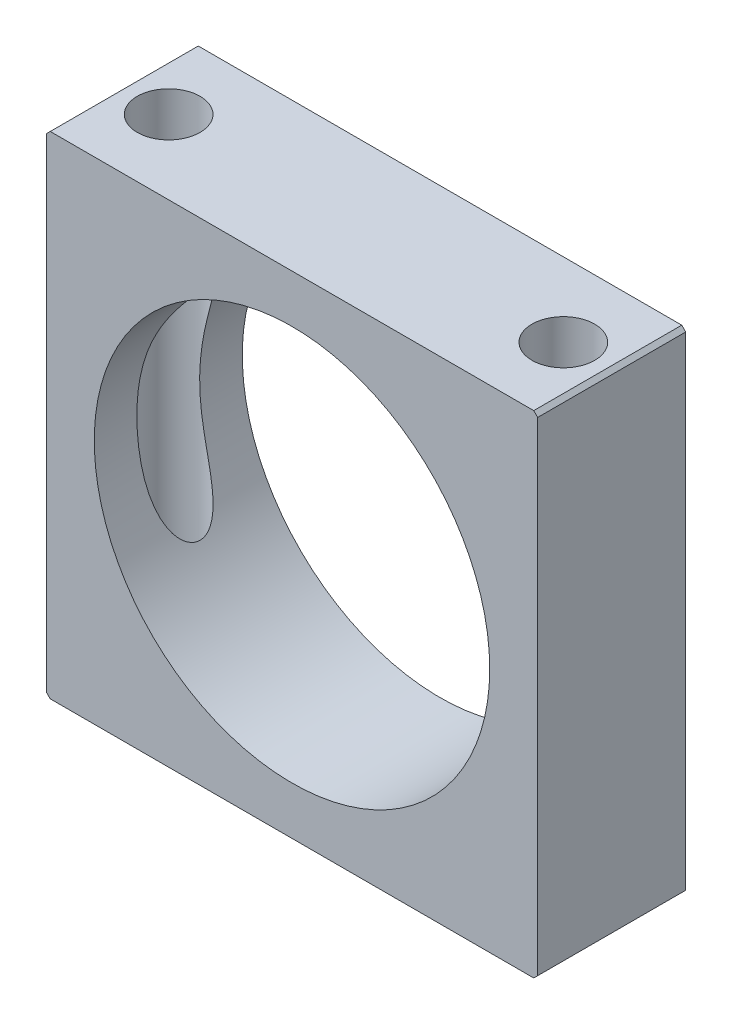
ISO-10303-21;
HEADER;
FILE_DESCRIPTION(('STEP AP214'),'2;1');
FILE_NAME('part.step','',(''),(''),'','','');
FILE_SCHEMA(('AUTOMOTIVE_DESIGN { 1 0 10303 214 1 1 1 1 }'));
ENDSEC;
DATA;
#1=APPLICATION_CONTEXT('core data for automotive mechanical design processes');
#2=APPLICATION_PROTOCOL_DEFINITION('international standard','automotive_design',2000,#1);
#3=PRODUCT_CONTEXT('',#1,'mechanical');
#4=PRODUCT('Part','Part','',(#3));
#5=PRODUCT_RELATED_PRODUCT_CATEGORY('part','',(#4));
#6=PRODUCT_DEFINITION_FORMATION('','',#4);
#7=PRODUCT_DEFINITION_CONTEXT('part definition',#1,'design');
#8=PRODUCT_DEFINITION('design','',#6,#7);
#9=PRODUCT_DEFINITION_SHAPE('','',#8);
#10=(LENGTH_UNIT() NAMED_UNIT(*) SI_UNIT(.MILLI.,.METRE.));
#11=(NAMED_UNIT(*) PLANE_ANGLE_UNIT() SI_UNIT($,.RADIAN.));
#12=(NAMED_UNIT(*) SI_UNIT($,.STERADIAN.) SOLID_ANGLE_UNIT());
#13=UNCERTAINTY_MEASURE_WITH_UNIT(LENGTH_MEASURE(1.E-05),#10,'distance_accuracy_value','');
#14=(GEOMETRIC_REPRESENTATION_CONTEXT(3) GLOBAL_UNCERTAINTY_ASSIGNED_CONTEXT((#13)) GLOBAL_UNIT_ASSIGNED_CONTEXT((#10,
#11,#12)) REPRESENTATION_CONTEXT('',''));
#15=CARTESIAN_POINT('',(0.,0.,0.));
#16=DIRECTION('',(0.,0.,1.));
#17=DIRECTION('',(1.,0.,0.));
#18=AXIS2_PLACEMENT_3D('',#15,#16,#17);
#19=CARTESIAN_POINT('',(0.,0.254000000000004,0.));
#20=DIRECTION('',(0.707106781186558,0.707106781186537,0.));
#21=DIRECTION('',(-0.707106781186537,0.707106781186558,0.));
#22=AXIS2_PLACEMENT_3D('',#19,#20,#21);
#23=PLANE('',#22);
#24=DIRECTION('',(0.,0.,1.));
#25=VECTOR('',#24,1.);
#26=CARTESIAN_POINT('',(0.253999999999997,0.,0.));
#27=LINE('',#26,#25);
#28=CARTESIAN_POINT('',(0.253999999999997,0.,9.525));
#29=VERTEX_POINT('',#28);
#30=CARTESIAN_POINT('',(0.253999999999997,0.,0.));
#31=VERTEX_POINT('',#30);
#32=EDGE_CURVE('E140',#29,#31,#27,.F.);
#33=ORIENTED_EDGE('',*,*,#32,.F.);
#34=DIRECTION('',(-0.707106781186537,0.707106781186558,0.));
#35=VECTOR('',#34,1.);
#36=CARTESIAN_POINT('',(0.,0.254000000000004,9.525));
#37=LINE('',#36,#35);
#38=CARTESIAN_POINT('',(0.,0.254000000000013,9.525));
#39=VERTEX_POINT('',#38);
#40=EDGE_CURVE('E98',#39,#29,#37,.F.);
#41=ORIENTED_EDGE('',*,*,#40,.F.);
#42=DIRECTION('',(0.,0.,1.));
#43=VECTOR('',#42,1.);
#44=CARTESIAN_POINT('',(0.,0.254000000000018,0.));
#45=LINE('',#44,#43);
#46=CARTESIAN_POINT('',(0.,0.254000000000013,0.));
#47=VERTEX_POINT('',#46);
#48=EDGE_CURVE('E97',#47,#39,#45,.T.);
#49=ORIENTED_EDGE('',*,*,#48,.F.);
#50=DIRECTION('',(0.707106781186527,-0.707106781186568,0.));
#51=VECTOR('',#50,1.);
#52=CARTESIAN_POINT('',(0.,0.254000000000015,0.));
#53=LINE('',#52,#51);
#54=EDGE_CURVE('E85',#47,#31,#53,.T.);
#55=ORIENTED_EDGE('',*,*,#54,.T.);
#56=EDGE_LOOP('',(#33,#41,#49,#55));
#57=FACE_BOUND('',#56,.T.);
#58=ADVANCED_FACE('F16',(#57),#23,.F.);
#59=CARTESIAN_POINT('',(31.369,0.,0.));
#60=DIRECTION('',(-0.707106781186547,0.707106781186548,0.));
#61=DIRECTION('',(-0.707106781186548,-0.707106781186547,0.));
#62=AXIS2_PLACEMENT_3D('',#59,#60,#61);
#63=PLANE('',#62);
#64=DIRECTION('',(0.,0.,-1.));
#65=VECTOR('',#64,1.);
#66=CARTESIAN_POINT('',(31.623,0.254000000000007,0.));
#67=LINE('',#66,#65);
#68=CARTESIAN_POINT('',(31.623,0.254000000000007,9.525));
#69=VERTEX_POINT('',#68);
#70=CARTESIAN_POINT('',(31.623,0.254000000000007,0.));
#71=VERTEX_POINT('',#70);
#72=EDGE_CURVE('E227',#69,#71,#67,.T.);
#73=ORIENTED_EDGE('',*,*,#72,.F.);
#74=DIRECTION('',(-0.707106781186548,-0.707106781186547,0.));
#75=VECTOR('',#74,1.);
#76=CARTESIAN_POINT('',(31.369,0.,9.525));
#77=LINE('',#76,#75);
#78=CARTESIAN_POINT('',(31.369,0.,9.525));
#79=VERTEX_POINT('',#78);
#80=EDGE_CURVE('E121',#79,#69,#77,.F.);
#81=ORIENTED_EDGE('',*,*,#80,.F.);
#82=DIRECTION('',(0.,0.,1.));
#83=VECTOR('',#82,1.);
#84=CARTESIAN_POINT('',(31.369,0.,0.));
#85=LINE('',#84,#83);
#86=CARTESIAN_POINT('',(31.369,0.,0.));
#87=VERTEX_POINT('',#86);
#88=EDGE_CURVE('E233',#87,#79,#85,.T.);
#89=ORIENTED_EDGE('',*,*,#88,.F.);
#90=DIRECTION('',(0.707106781186555,0.70710678118654,0.));
#91=VECTOR('',#90,1.);
#92=CARTESIAN_POINT('',(31.369,0.,0.));
#93=LINE('',#92,#91);
#94=EDGE_CURVE('E117',#87,#71,#93,.T.);
#95=ORIENTED_EDGE('',*,*,#94,.T.);
#96=EDGE_LOOP('',(#73,#81,#89,#95));
#97=FACE_BOUND('',#96,.T.);
#98=ADVANCED_FACE('F201',(#97),#63,.F.);
#99=CARTESIAN_POINT('',(28.5115,0.,4.7625));
#100=DIRECTION('',(0.,1.,0.));
#101=DIRECTION('',(0.,0.,1.));
#102=AXIS2_PLACEMENT_3D('',#99,#100,#101);
#103=CYLINDRICAL_SURFACE('',#102,2.0193);
#104=CARTESIAN_POINT('',(28.5115,0.,4.7625));
#105=DIRECTION('',(0.,1.,0.));
#106=DIRECTION('',(0.,0.,1.));
#107=AXIS2_PLACEMENT_3D('',#104,#105,#106);
#108=CIRCLE('',#107,2.0193);
#109=CARTESIAN_POINT('',(28.5115,0.,6.7818));
#110=VERTEX_POINT('',#109);
#111=EDGE_CURVE('E141',#110,#110,#108,.T.);
#112=ORIENTED_EDGE('',*,*,#111,.F.);
#113=EDGE_LOOP('',(#112));
#114=FACE_BOUND('',#113,.T.);
#115=CARTESIAN_POINT('',(28.5115,31.623,4.7625));
#116=DIRECTION('',(0.,1.,0.));
#117=DIRECTION('',(0.,0.,1.));
#118=AXIS2_PLACEMENT_3D('',#115,#116,#117);
#119=CIRCLE('',#118,2.0193);
#120=CARTESIAN_POINT('',(28.5115,31.623,6.7818));
#121=VERTEX_POINT('',#120);
#122=EDGE_CURVE('E133',#121,#121,#119,.F.);
#123=ORIENTED_EDGE('',*,*,#122,.F.);
#124=EDGE_LOOP('',(#123));
#125=FACE_BOUND('',#124,.T.);
#126=CARTESIAN_POINT('',(28.5115,16.6151200345937,2.74319999999999));
#127=CARTESIAN_POINT('',(28.5199653212104,16.4813430370531,2.74320270239754));
#128=CARTESIAN_POINT('',(28.5263158762675,16.3474399768635,2.74325062802151));
#129=CARTESIAN_POINT('',(28.5347827517717,16.0795244702182,2.74332907875549));
#130=CARTESIAN_POINT('',(28.5368999709793,15.945512053025,2.74335960755796));
#131=CARTESIAN_POINT('',(28.536900029006,15.6775559166359,2.74335990186155));
#132=CARTESIAN_POINT('',(28.5347850149188,15.5436121970708,2.7433296981734));
#133=CARTESIAN_POINT('',(28.526322201603,15.2756951322222,2.74325009105277));
#134=CARTESIAN_POINT('',(28.5199692103383,15.141721952357,2.74320066410047));
#135=CARTESIAN_POINT('',(28.5006511685445,14.836431967293,2.74319914930508));
#136=CARTESIAN_POINT('',(28.4863298494317,14.6651992426276,2.74327831319996));
#137=CARTESIAN_POINT('',(28.4507639873802,14.3234367237259,2.74403545692543));
#138=CARTESIAN_POINT('',(28.4295186182925,14.1529070158304,2.74471350822932));
#139=CARTESIAN_POINT('',(28.3801081029875,13.8126273188276,2.74732705653674));
#140=CARTESIAN_POINT('',(28.3519337391881,13.6428786777253,2.74926423423161));
#141=CARTESIAN_POINT('',(28.2887344511936,13.3047070137621,2.75527405754353));
#142=CARTESIAN_POINT('',(28.2537099752288,13.136283904916,2.75934656346674));
#143=CARTESIAN_POINT('',(28.1769646117507,12.8014278569892,2.77072658272209));
#144=CARTESIAN_POINT('',(28.1352572434751,12.6349916138971,2.77802761625686));
#145=CARTESIAN_POINT('',(28.0452092323457,12.3041426687441,2.7972347694156));
#146=CARTESIAN_POINT('',(27.9968673350173,12.1397303557952,2.80914176072264));
#147=CARTESIAN_POINT('',(27.8938736743695,11.8138519914117,2.83922573844674));
#148=CARTESIAN_POINT('',(27.8392357894094,11.6523803350742,2.85738910332814));
#149=CARTESIAN_POINT('',(27.7239329906724,11.3328225229877,2.90208533464119));
#150=CARTESIAN_POINT('',(27.6632714901554,11.1747345109502,2.92861347953247));
#151=CARTESIAN_POINT('',(27.5611040048811,10.9234282453846,2.98030993829984));
#152=CARTESIAN_POINT('',(27.5212840116499,10.8288109678863,3.00202178517003));
#153=CARTESIAN_POINT('',(27.4398400254016,10.6415939416869,3.050377247796));
#154=CARTESIAN_POINT('',(27.3982156979782,10.5489945717947,3.07702178076999));
#155=CARTESIAN_POINT('',(27.3135925758823,10.3665242495133,3.13607804401843));
#156=CARTESIAN_POINT('',(27.2705968024584,10.2766480494975,3.16847773059296));
#157=CARTESIAN_POINT('',(27.1836682807955,10.1001723616852,3.24013158612093));
#158=CARTESIAN_POINT('',(27.1397360141316,10.0135712503972,3.27938230329852));
#159=CARTESIAN_POINT('',(27.0428235727008,9.82766971518366,3.37466896265823));
#160=CARTESIAN_POINT('',(26.9897907548617,9.72929256687629,3.43249187626515));
#161=CARTESIAN_POINT('',(26.8854037535374,9.54125584218823,3.56236770191023));
#162=CARTESIAN_POINT('',(26.8340480633198,9.45158828961998,3.63440740742342));
#163=CARTESIAN_POINT('',(26.7500560588286,9.30852636786551,3.77281480481567));
#164=CARTESIAN_POINT('',(26.7161946798853,9.25199167963295,3.83515712711531));
#165=CARTESIAN_POINT('',(26.6530714006376,9.14818213783625,3.96922714840786));
#166=CARTESIAN_POINT('',(26.6238016963597,9.10089153867167,4.04093853501115));
#167=CARTESIAN_POINT('',(26.5782901191154,9.02817900877144,4.17589592751221));
#168=CARTESIAN_POINT('',(26.5606005197941,9.00022890095212,4.23727886934799));
#169=CARTESIAN_POINT('',(26.530700673956,8.9532698465948,4.36466399569805));
#170=CARTESIAN_POINT('',(26.5184864081335,8.93425434089277,4.43066275058029));
#171=CARTESIAN_POINT('',(26.5005967821325,8.90648006472163,4.56618929204118));
#172=CARTESIAN_POINT('',(26.4949681743239,8.89779462150321,4.63573869579954));
#173=CARTESIAN_POINT('',(26.4910334801698,8.89171771459723,4.77553213975767));
#174=CARTESIAN_POINT('',(26.4927247769399,8.89432221472707,4.84577592275619));
#175=CARTESIAN_POINT('',(26.502651666022,8.90967819577877,4.97686824520258));
#176=CARTESIAN_POINT('',(26.5101595332167,8.92130154238223,5.03791113034199));
#177=CARTESIAN_POINT('',(26.530196103875,8.95251309430616,5.15703949635868));
#178=CARTESIAN_POINT('',(26.5427265405966,8.97210404923387,5.21512394849178));
#179=CARTESIAN_POINT('',(26.57694270403,9.0260469027609,5.34654892578309));
#180=CARTESIAN_POINT('',(26.6002937427548,9.06315517287232,5.4183210162055));
#181=CARTESIAN_POINT('',(26.6522961811466,9.1470128956751,5.55384791767831));
#182=CARTESIAN_POINT('',(26.6809581643453,9.19378162124462,5.61758628550761));
#183=CARTESIAN_POINT('',(26.7567395024462,9.3195659189768,5.76671740611479));
#184=CARTESIAN_POINT('',(26.8059710354522,9.4030823048063,5.84720607711694));
#185=CARTESIAN_POINT('',(26.9076837203132,9.58084362320606,5.99264253749174));
#186=CARTESIAN_POINT('',(26.9601715653595,9.67511101114221,6.05755688646532));
#187=CARTESIAN_POINT('',(27.0598160898548,9.85994815666871,6.16786700297967));
#188=CARTESIAN_POINT('',(27.1069116055799,9.94974997418169,6.21463444727179));
#189=CARTESIAN_POINT('',(27.2004730258325,10.1336696801777,6.29963354602526));
#190=CARTESIAN_POINT('',(27.2469383894366,10.2277910059898,6.33785825533661));
#191=CARTESIAN_POINT('',(27.3385654476197,10.4194794845627,6.40721975903296));
#192=CARTESIAN_POINT('',(27.3837239184833,10.5170540240365,6.4383401472906));
#193=CARTESIAN_POINT('',(27.4721306897576,10.7147147019151,6.49455815108557));
#194=CARTESIAN_POINT('',(27.515379455027,10.8148002196941,6.51965723898987));
#195=CARTESIAN_POINT('',(27.6012065605999,11.020725490405,6.56566280556071));
#196=CARTESIAN_POINT('',(27.6437016974488,11.1266414750135,6.58638106462946));
#197=CARTESIAN_POINT('',(27.7260715508051,11.3402686968131,6.62333483550237));
#198=CARTESIAN_POINT('',(27.7659456990083,11.4479803170433,6.63956937753766));
#199=CARTESIAN_POINT('',(27.8814369784417,11.7735029371737,6.68275843258262));
#200=CARTESIAN_POINT('',(27.9528606496037,11.9935525731978,6.704167592949));
#201=CARTESIAN_POINT('',(28.0837726819043,12.4379435300594,6.73712794314051));
#202=CARTESIAN_POINT('',(28.1432536681567,12.6622874096153,6.74867305592211));
#203=CARTESIAN_POINT('',(28.2498686036745,13.1139815977602,6.76550530758962));
#204=CARTESIAN_POINT('',(28.2970089588245,13.3413302819456,6.77079569826742));
#205=CARTESIAN_POINT('',(28.3804709444385,13.8077062009253,6.77799711241717));
#206=CARTESIAN_POINT('',(28.4162676544204,14.0468290783341,6.77976014095217));
#207=CARTESIAN_POINT('',(28.4741517207061,14.5264596465523,6.7816630688818));
#208=CARTESIAN_POINT('',(28.4962550825482,14.7669653877115,6.78180486665852));
#209=CARTESIAN_POINT('',(28.5199653212104,15.1416569629469,6.78179729760245));
#210=CARTESIAN_POINT('',(28.5263158762675,15.2755600231365,6.78174937197848));
#211=CARTESIAN_POINT('',(28.5347827517717,15.5434755297818,6.7816709212445));
#212=CARTESIAN_POINT('',(28.5368999709793,15.677487946975,6.78164039244203));
#213=CARTESIAN_POINT('',(28.536900029006,15.9454440833641,6.78164009813845));
#214=CARTESIAN_POINT('',(28.5347850149188,16.0793878029292,6.7816703018266));
#215=CARTESIAN_POINT('',(28.526322201603,16.3473048677777,6.78174990894722));
#216=CARTESIAN_POINT('',(28.5199692103383,16.481278047643,6.78179933589952));
#217=CARTESIAN_POINT('',(28.5006511685445,16.786568032707,6.78180085069491));
#218=CARTESIAN_POINT('',(28.4863298494317,16.9578007573724,6.78172168680003));
#219=CARTESIAN_POINT('',(28.4507639873802,17.2995632762741,6.78096454307456));
#220=CARTESIAN_POINT('',(28.4295186182925,17.4700929841696,6.78028649177068));
#221=CARTESIAN_POINT('',(28.3801081029875,17.8103726811724,6.77767294346325));
#222=CARTESIAN_POINT('',(28.3519337391881,17.9801213222747,6.77573576576838));
#223=CARTESIAN_POINT('',(28.2887344511936,18.3182929862379,6.76972594245647));
#224=CARTESIAN_POINT('',(28.2537099752288,18.486716095084,6.76565343653326));
#225=CARTESIAN_POINT('',(28.1769646117507,18.8215721430108,6.75427341727791));
#226=CARTESIAN_POINT('',(28.1352572434751,18.9880083861029,6.74697238374313));
#227=CARTESIAN_POINT('',(28.0452092323457,19.3188573312559,6.7277652305844));
#228=CARTESIAN_POINT('',(27.9968673350173,19.4832696442048,6.71585823927735));
#229=CARTESIAN_POINT('',(27.8938736743695,19.8091480085883,6.68577426155325));
#230=CARTESIAN_POINT('',(27.8392357894094,19.9706196649258,6.66761089667185));
#231=CARTESIAN_POINT('',(27.7239329906724,20.2901774770123,6.6229146653588));
#232=CARTESIAN_POINT('',(27.6632714901554,20.4482654890498,6.59638652046752));
#233=CARTESIAN_POINT('',(27.5611040048811,20.6995717546154,6.54469006170015));
#234=CARTESIAN_POINT('',(27.5212840116499,20.7941890321136,6.52297821482996));
#235=CARTESIAN_POINT('',(27.4398400254016,20.9814060583131,6.47462275220399));
#236=CARTESIAN_POINT('',(27.3982156979782,21.0740054282053,6.44797821923));
#237=CARTESIAN_POINT('',(27.3135925758823,21.2564757504867,6.38892195598156));
#238=CARTESIAN_POINT('',(27.2705968024584,21.3463519505025,6.35652226940703));
#239=CARTESIAN_POINT('',(27.1836682807954,21.5228276383148,6.28486841387906));
#240=CARTESIAN_POINT('',(27.1397360141316,21.6094287496028,6.24561769670148));
#241=CARTESIAN_POINT('',(27.0428235727008,21.7953302848163,6.15033103734176));
#242=CARTESIAN_POINT('',(26.9897907548617,21.8937074331237,6.09250812373485));
#243=CARTESIAN_POINT('',(26.8854037535374,22.0817441578118,5.96263229808976));
#244=CARTESIAN_POINT('',(26.8340480633198,22.17141171038,5.89059259257657));
#245=CARTESIAN_POINT('',(26.7500560588286,22.3144736321345,5.75218519518432));
#246=CARTESIAN_POINT('',(26.7161946798853,22.371008320367,5.68984287288469));
#247=CARTESIAN_POINT('',(26.6530714006376,22.4748178621637,5.55577285159213));
#248=CARTESIAN_POINT('',(26.6238016963597,22.5221084613283,5.48406146498885));
#249=CARTESIAN_POINT('',(26.5782901191154,22.5948209912286,5.34910407248778));
#250=CARTESIAN_POINT('',(26.5606005197941,22.6227710990479,5.28772113065201));
#251=CARTESIAN_POINT('',(26.530700673956,22.6697301534052,5.16033600430194));
#252=CARTESIAN_POINT('',(26.5184864081335,22.6887456591072,5.0943372494197));
#253=CARTESIAN_POINT('',(26.5005967821325,22.7165199352784,4.95881070795881));
#254=CARTESIAN_POINT('',(26.4949681743239,22.7252053784968,4.88926130420045));
#255=CARTESIAN_POINT('',(26.4910334801698,22.7312822854028,4.74946786024232));
#256=CARTESIAN_POINT('',(26.4927247769399,22.7286777852729,4.6792240772438));
#257=CARTESIAN_POINT('',(26.502651666022,22.7133218042212,4.54813175479741));
#258=CARTESIAN_POINT('',(26.5101595332167,22.7016984576178,4.487088869658));
#259=CARTESIAN_POINT('',(26.530196103875,22.6704869056938,4.36796050364131));
#260=CARTESIAN_POINT('',(26.5427265405966,22.6508959507661,4.30987605150821));
#261=CARTESIAN_POINT('',(26.57694270403,22.5969530972391,4.1784510742169));
#262=CARTESIAN_POINT('',(26.6002937427548,22.5598448271277,4.10667898379449));
#263=CARTESIAN_POINT('',(26.6522961811466,22.4759871043249,3.97115208232168));
#264=CARTESIAN_POINT('',(26.6809581643453,22.4292183787554,3.90741371449238));
#265=CARTESIAN_POINT('',(26.7567395024462,22.3034340810232,3.7582825938852));
#266=CARTESIAN_POINT('',(26.8059710354522,22.2199176951937,3.67779392288305));
#267=CARTESIAN_POINT('',(26.9076837203132,22.0421563767939,3.53235746250825));
#268=CARTESIAN_POINT('',(26.9601715653595,21.9478889888578,3.46744311353467));
#269=CARTESIAN_POINT('',(27.0598160898548,21.7630518433313,3.35713299702032));
#270=CARTESIAN_POINT('',(27.1069116055799,21.6732500258183,3.3103655527282));
#271=CARTESIAN_POINT('',(27.2004730258325,21.4893303198223,3.22536645397473));
#272=CARTESIAN_POINT('',(27.2469383894366,21.3952089940102,3.18714174466338));
#273=CARTESIAN_POINT('',(27.3385654476197,21.2035205154373,3.11778024096703));
#274=CARTESIAN_POINT('',(27.3837239184833,21.1059459759635,3.08665985270939));
#275=CARTESIAN_POINT('',(27.4721306897576,20.9082852980849,3.03044184891442));
#276=CARTESIAN_POINT('',(27.515379455027,20.8081997803059,3.00534276101012));
#277=CARTESIAN_POINT('',(27.6012065605999,20.602274509595,2.95933719443928));
#278=CARTESIAN_POINT('',(27.6437016974488,20.4963585249865,2.93861893537053));
#279=CARTESIAN_POINT('',(27.7260715508051,20.2827313031868,2.90166516449762));
#280=CARTESIAN_POINT('',(27.7659456990083,20.1750196829567,2.88543062246233));
#281=CARTESIAN_POINT('',(27.8814369784417,19.8494970628263,2.84224156741738));
#282=CARTESIAN_POINT('',(27.9528606496037,19.6294474268022,2.82083240705099));
#283=CARTESIAN_POINT('',(28.0837726819043,19.1850564699406,2.78787205685948));
#284=CARTESIAN_POINT('',(28.1432536681567,18.9607125903847,2.77632694407788));
#285=CARTESIAN_POINT('',(28.2498686036745,18.5090184022398,2.75949469241037));
#286=CARTESIAN_POINT('',(28.2970089588245,18.2816697180544,2.75420430173257));
#287=CARTESIAN_POINT('',(28.3804709444385,17.8152937990747,2.74700288758283));
#288=CARTESIAN_POINT('',(28.4162676544204,17.5761709216659,2.74523985904783));
#289=CARTESIAN_POINT('',(28.4741517207061,17.0965403534477,2.74333693111819));
#290=CARTESIAN_POINT('',(28.4962550825482,16.8560346122885,2.74319513334148));
#291=CARTESIAN_POINT('',(28.5115,16.6151200345937,2.74319999999999));
#292=B_SPLINE_CURVE_WITH_KNOTS('',3,(#126,#127,#128,#129,#130,#131,#132,#133,#134,#135,#136,
#137,#138,#139,#140,#141,#142,#143,#144,#145,#146,#147,#148,#149,#150,#151,#152,#153,#154,#155,
#156,#157,#158,#159,#160,#161,#162,#163,#164,#165,#166,#167,#168,#169,#170,#171,#172,#173,#174,
#175,#176,#177,#178,#179,#180,#181,#182,#183,#184,#185,#186,#187,#188,#189,#190,#191,#192,#193,
#194,#195,#196,#197,#198,#199,#200,#201,#202,#203,#204,#205,#206,#207,#208,#209,#210,#211,#212,
#213,#214,#215,#216,#217,#218,#219,#220,#221,#222,#223,#224,#225,#226,#227,#228,#229,#230,#231,
#232,#233,#234,#235,#236,#237,#238,#239,#240,#241,#242,#243,#244,#245,#246,#247,#248,#249,#250,
#251,#252,#253,#254,#255,#256,#257,#258,#259,#260,#261,#262,#263,#264,#265,#266,#267,#268,#269,
#270,#271,#272,#273,#274,#275,#276,#277,#278,#279,#280,#281,#282,#283,#284,#285,#286,#287,#288,
#289,#290,#291),.UNSPECIFIED.,.T.,.F.,(4,2,2,2,2,2,2,2,2,2,2,2,2,2,2,2,2,2,2,2,2,2,2,2,2,2,2,2,
2,2,2,2,2,2,2,2,2,2,2,2,2,2,2,2,2,2,2,2,2,2,2,2,2,2,2,2,2,2,2,2,2,2,2,2,2,2,2,2,2,2,2,2,2,2,2,2,
2,2,2,2,2,2,4),(0.,0.40210354142174,0.804121705000044,1.20593596872273,1.6082434099645,
2.12358845973877,2.63899502087777,3.15509096730215,3.67115315477977,4.18618425078339,
4.70131286476891,5.21532694358039,5.72905140248845,6.04370670327851,6.35842057215425,
6.67248344208353,6.98638853111204,7.36306166959052,7.73938653512679,8.01071437980907,
8.28157596150202,8.4899567200692,8.69818426001524,8.90788123152498,9.11750324203387,
9.30444924962508,9.49145982676311,9.74236854129282,9.99378274603126,10.3696803912375,
10.7463780630539,11.0808945812981,11.4156820764171,11.7512350524477,12.0867058930888,
12.4345188051393,12.7824068857297,13.4786748948486,14.1753715521646,14.8717058416363,
15.5966898402826,16.3208248309917,16.7229283724135,17.1249465359918,17.5267607997144,
17.9290682409562,18.4444132907305,18.9598198518695,19.4759157982939,19.9919779857715,
20.5070090817751,21.0221376957606,21.5361517745721,22.0498762334802,22.3645315342702,
22.679245403146,22.9933082730753,23.3072133621038,23.6838865005822,24.0602113661185,
24.3315392108008,24.6024007924937,24.8107815510609,25.019009091007,25.2287060625167,
25.4383280730256,25.6252740806168,25.8122846577548,26.0631933722846,26.314607577023,
26.6905052222292,27.0672028940456,27.4017194122898,27.7365069074088,28.0720598834394,
28.4075307240805,28.7553436361311,29.1032317167214,29.7994997258403,30.4961963831563,
31.1925306726281,31.9175146712743,32.6416496619835),.UNSPECIFIED.);
#293=CARTESIAN_POINT('',(28.5115,16.6151200345937,2.74319999999999));
#294=VERTEX_POINT('',#293);
#295=EDGE_CURVE('E19',#294,#294,#292,.T.);
#296=ORIENTED_EDGE('',*,*,#295,.T.);
#297=EDGE_LOOP('',(#296));
#298=FACE_BOUND('',#297,.T.);
#299=ADVANCED_FACE('F169',(#114,#125,#298),#103,.F.);
#300=CARTESIAN_POINT('',(3.1115,0.,4.7625));
#301=DIRECTION('',(0.,1.,0.));
#302=DIRECTION('',(0.,0.,1.));
#303=AXIS2_PLACEMENT_3D('',#300,#301,#302);
#304=CYLINDRICAL_SURFACE('',#303,2.0193);
#305=CARTESIAN_POINT('',(3.1115,16.6151200345936,6.7818));
#306=CARTESIAN_POINT('',(3.10303467878958,16.481343037053,6.78179729760245));
#307=CARTESIAN_POINT('',(3.09668412373254,16.3474399768634,6.78174937197848));
#308=CARTESIAN_POINT('',(3.08821724822826,16.0795244702181,6.7816709212445));
#309=CARTESIAN_POINT('',(3.08610002902073,15.945512053025,6.78164039244204));
#310=CARTESIAN_POINT('',(3.08609997099397,15.677555916636,6.78164009813845));
#311=CARTESIAN_POINT('',(3.08821498508121,15.5436121970708,6.7816703018266));
#312=CARTESIAN_POINT('',(3.09667779839696,15.2756951322223,6.78174990894723));
#313=CARTESIAN_POINT('',(3.10303078966174,15.1417219523571,6.78179933589952));
#314=CARTESIAN_POINT('',(3.12234883145549,14.8364319672931,6.78180085069491));
#315=CARTESIAN_POINT('',(3.13667015056824,14.6651992426277,6.78172168680004));
#316=CARTESIAN_POINT('',(3.17223601261975,14.323436723726,6.78096454307456));
#317=CARTESIAN_POINT('',(3.1934813817075,14.1529070158306,6.78028649177068));
#318=CARTESIAN_POINT('',(3.24289189701244,13.8126273188277,6.77767294346325));
#319=CARTESIAN_POINT('',(3.27106626081184,13.6428786777255,6.77573576576838));
#320=CARTESIAN_POINT('',(3.33426554880642,13.3047070137623,6.76972594245647));
#321=CARTESIAN_POINT('',(3.36929002477115,13.1362839049161,6.76565343653326));
#322=CARTESIAN_POINT('',(3.44603538824928,12.8014278569893,6.75427341727791));
#323=CARTESIAN_POINT('',(3.48774275652484,12.6349916138972,6.74697238374314));
#324=CARTESIAN_POINT('',(3.57779076765423,12.3041426687442,6.7277652305844));
#325=CARTESIAN_POINT('',(3.6261326649827,12.1397303557953,6.71585823927736));
#326=CARTESIAN_POINT('',(3.72912632563049,11.8138519914118,6.68577426155326));
#327=CARTESIAN_POINT('',(3.78376421059059,11.6523803350743,6.66761089667187));
#328=CARTESIAN_POINT('',(3.89906700932753,11.3328225229879,6.62291466535881));
#329=CARTESIAN_POINT('',(3.95972850984452,11.1747345109503,6.59638652046754));
#330=CARTESIAN_POINT('',(4.0618959951189,10.9234282453847,6.54469006170017));
#331=CARTESIAN_POINT('',(4.1017159883501,10.8288109678864,6.52297821482998));
#332=CARTESIAN_POINT('',(4.18315997459838,10.6415939416869,6.47462275220401));
#333=CARTESIAN_POINT('',(4.22478430202177,10.5489945717947,6.44797821923002));
#334=CARTESIAN_POINT('',(4.30940742411767,10.3665242495133,6.38892195598158));
#335=CARTESIAN_POINT('',(4.35240319754159,10.2766480494976,6.35652226940705));
#336=CARTESIAN_POINT('',(4.43933171920453,10.1001723616853,6.28486841387908));
#337=CARTESIAN_POINT('',(4.48326398586839,10.0135712503973,6.24561769670149));
#338=CARTESIAN_POINT('',(4.58017642729918,9.82766971518369,6.15033103734177));
#339=CARTESIAN_POINT('',(4.6332092451383,9.72929256687632,6.09250812373486));
#340=CARTESIAN_POINT('',(4.7375962464626,9.54125584218826,5.96263229808978));
#341=CARTESIAN_POINT('',(4.78895193668016,9.45158828962002,5.89059259257659));
#342=CARTESIAN_POINT('',(4.87294394117134,9.30852636786555,5.75218519518435));
#343=CARTESIAN_POINT('',(4.90680532011464,9.25199167963299,5.68984287288471));
#344=CARTESIAN_POINT('',(4.96992859936243,9.14818213783628,5.55577285159216));
#345=CARTESIAN_POINT('',(4.99919830364024,9.1008915386717,5.48406146498887));
#346=CARTESIAN_POINT('',(5.04470988088462,9.02817900877146,5.3491040724878));
#347=CARTESIAN_POINT('',(5.06239948020592,9.00022890095214,5.28772113065203));
#348=CARTESIAN_POINT('',(5.09229932604396,8.95326984659481,5.16033600430196));
#349=CARTESIAN_POINT('',(5.10451359186649,8.93425434089279,5.09433724941972));
#350=CARTESIAN_POINT('',(5.12240321786751,8.90648006472165,4.95881070795883));
#351=CARTESIAN_POINT('',(5.12803182567607,8.89779462150323,4.88926130420047));
#352=CARTESIAN_POINT('',(5.13196651983023,8.89171771459725,4.74946786024234));
#353=CARTESIAN_POINT('',(5.13027522306011,8.89432221472708,4.67922407724382));
#354=CARTESIAN_POINT('',(5.12034833397796,8.90967819577878,4.54813175479743));
#355=CARTESIAN_POINT('',(5.11284046678328,8.92130154238224,4.48708886965802));
#356=CARTESIAN_POINT('',(5.09280389612503,8.95251309430617,4.36796050364133));
#357=CARTESIAN_POINT('',(5.08027345940335,8.97210404923388,4.30987605150823));
#358=CARTESIAN_POINT('',(5.04605729597002,9.02604690276091,4.17845107421692));
#359=CARTESIAN_POINT('',(5.02270625724518,9.06315517287233,4.10667898379451));
#360=CARTESIAN_POINT('',(4.97070381885335,9.1470128956751,3.9711520823217));
#361=CARTESIAN_POINT('',(4.94204183565467,9.19378162124462,3.9074137144924));
#362=CARTESIAN_POINT('',(4.86626049755376,9.3195659189768,3.75828259388523));
#363=CARTESIAN_POINT('',(4.81702896454783,9.4030823048063,3.67779392288308));
#364=CARTESIAN_POINT('',(4.71531627968681,9.58084362320606,3.53235746250828));
#365=CARTESIAN_POINT('',(4.66282843464055,9.6751110111422,3.4674431135347));
#366=CARTESIAN_POINT('',(4.56318391014516,9.8599481566687,3.35713299702035));
#367=CARTESIAN_POINT('',(4.5160883944201,9.94974997418167,3.31036555272823));
#368=CARTESIAN_POINT('',(4.42252697416751,10.1336696801777,3.22536645397475));
#369=CARTESIAN_POINT('',(4.37606161056346,10.2277910059898,3.1871417446634));
#370=CARTESIAN_POINT('',(4.28443455238028,10.4194794845627,3.11778024096705));
#371=CARTESIAN_POINT('',(4.23927608151668,10.5170540240364,3.08665985270942));
#372=CARTESIAN_POINT('',(4.15086931024237,10.7147147019151,3.03044184891444));
#373=CARTESIAN_POINT('',(4.10762054497305,10.8148002196941,3.00534276101014));
#374=CARTESIAN_POINT('',(4.02179343940012,11.020725490405,2.9593371944393));
#375=CARTESIAN_POINT('',(3.97929830255117,11.1266414750134,2.93861893537055));
#376=CARTESIAN_POINT('',(3.89692844919489,11.3402686968131,2.90166516449764));
#377=CARTESIAN_POINT('',(3.85705430099169,11.4479803170432,2.88543062246235));
#378=CARTESIAN_POINT('',(3.74156302155836,11.7735029371737,2.84224156741739));
#379=CARTESIAN_POINT('',(3.67013935039628,11.9935525731977,2.820832407051));
#380=CARTESIAN_POINT('',(3.53922731809574,12.4379435300593,2.78787205685949));
#381=CARTESIAN_POINT('',(3.47974633184333,12.6622874096152,2.77632694407789));
#382=CARTESIAN_POINT('',(3.37313139632555,13.1139815977601,2.75949469241038));
#383=CARTESIAN_POINT('',(3.32599104117548,13.3413302819455,2.75420430173258));
#384=CARTESIAN_POINT('',(3.2425290555615,13.8077062009252,2.74700288758283));
#385=CARTESIAN_POINT('',(3.20673234557958,14.046829078334,2.74523985904783));
#386=CARTESIAN_POINT('',(3.14884827929394,14.5264596465523,2.7433369311182));
#387=CARTESIAN_POINT('',(3.12674491745181,14.7669653877116,2.74319513334148));
#388=CARTESIAN_POINT('',(3.10303467878959,15.141656962947,2.74320270239755));
#389=CARTESIAN_POINT('',(3.09668412373254,15.2755600231366,2.74325062802152));
#390=CARTESIAN_POINT('',(3.08821724822826,15.5434755297819,2.7433290787555));
#391=CARTESIAN_POINT('',(3.08610002902073,15.677487946975,2.74335960755796));
#392=CARTESIAN_POINT('',(3.08609997099397,15.945444083364,2.74335990186155));
#393=CARTESIAN_POINT('',(3.08821498508121,16.0793878029292,2.7433296981734));
#394=CARTESIAN_POINT('',(3.09667779839696,16.3473048677777,2.74325009105277));
#395=CARTESIAN_POINT('',(3.10303078966174,16.4812780476429,2.74320066410048));
#396=CARTESIAN_POINT('',(3.12234883145549,16.7865680327069,2.74319914930509));
#397=CARTESIAN_POINT('',(3.13667015056824,16.9578007573723,2.74327831319997));
#398=CARTESIAN_POINT('',(3.17223601261975,17.299563276274,2.74403545692544));
#399=CARTESIAN_POINT('',(3.1934813817075,17.4700929841694,2.74471350822932));
#400=CARTESIAN_POINT('',(3.24289189701244,17.8103726811723,2.74732705653675));
#401=CARTESIAN_POINT('',(3.27106626081184,17.9801213222745,2.74926423423162));
#402=CARTESIAN_POINT('',(3.33426554880642,18.3182929862377,2.75527405754353));
#403=CARTESIAN_POINT('',(3.36929002477116,18.4867160950839,2.75934656346674));
#404=CARTESIAN_POINT('',(3.44603538824928,18.8215721430107,2.77072658272209));
#405=CARTESIAN_POINT('',(3.48774275652484,18.9880083861028,2.77802761625686));
#406=CARTESIAN_POINT('',(3.57779076765423,19.3188573312558,2.7972347694156));
#407=CARTESIAN_POINT('',(3.6261326649827,19.4832696442047,2.80914176072264));
#408=CARTESIAN_POINT('',(3.72912632563049,19.8091480085882,2.83922573844674));
#409=CARTESIAN_POINT('',(3.78376421059059,19.9706196649257,2.85738910332813));
#410=CARTESIAN_POINT('',(3.89906700932753,20.2901774770121,2.90208533464118));
#411=CARTESIAN_POINT('',(3.95972850984451,20.4482654890497,2.92861347953246));
#412=CARTESIAN_POINT('',(4.06189599511889,20.6995717546153,2.98030993829983));
#413=CARTESIAN_POINT('',(4.1017159883501,20.7941890321135,3.00202178517002));
#414=CARTESIAN_POINT('',(4.18315997459838,20.9814060583131,3.05037724779599));
#415=CARTESIAN_POINT('',(4.22478430202177,21.0740054282053,3.07702178076998));
#416=CARTESIAN_POINT('',(4.30940742411767,21.2564757504867,3.13607804401842));
#417=CARTESIAN_POINT('',(4.35240319754159,21.3463519505024,3.16847773059295));
#418=CARTESIAN_POINT('',(4.43933171920453,21.5228276383147,3.24013158612092));
#419=CARTESIAN_POINT('',(4.48326398586839,21.6094287496027,3.27938230329851));
#420=CARTESIAN_POINT('',(4.58017642729917,21.7953302848163,3.37466896265823));
#421=CARTESIAN_POINT('',(4.6332092451383,21.8937074331237,3.43249187626514));
#422=CARTESIAN_POINT('',(4.7375962464626,22.0817441578117,3.56236770191022));
#423=CARTESIAN_POINT('',(4.78895193668016,22.17141171038,3.63440740742341));
#424=CARTESIAN_POINT('',(4.87294394117134,22.3144736321345,3.77281480481565));
#425=CARTESIAN_POINT('',(4.90680532011464,22.371008320367,3.83515712711529));
#426=CARTESIAN_POINT('',(4.96992859936243,22.4748178621637,3.96922714840784));
#427=CARTESIAN_POINT('',(4.99919830364024,22.5221084613283,4.04093853501113));
#428=CARTESIAN_POINT('',(5.04470988088462,22.5948209912285,4.1758959275122));
#429=CARTESIAN_POINT('',(5.06239948020592,22.6227710990479,4.23727886934797));
#430=CARTESIAN_POINT('',(5.09229932604396,22.6697301534052,4.36466399569803));
#431=CARTESIAN_POINT('',(5.10451359186649,22.6887456591072,4.43066275058027));
#432=CARTESIAN_POINT('',(5.12240321786751,22.7165199352784,4.56618929204116));
#433=CARTESIAN_POINT('',(5.12803182567607,22.7252053784968,4.63573869579952));
#434=CARTESIAN_POINT('',(5.13196651983022,22.7312822854027,4.77553213975766));
#435=CARTESIAN_POINT('',(5.13027522306011,22.7286777852729,4.84577592275618));
#436=CARTESIAN_POINT('',(5.12034833397796,22.7133218042212,4.97686824520257));
#437=CARTESIAN_POINT('',(5.11284046678328,22.7016984576178,5.03791113034198));
#438=CARTESIAN_POINT('',(5.09280389612503,22.6704869056938,5.15703949635867));
#439=CARTESIAN_POINT('',(5.08027345940335,22.6508959507661,5.21512394849176));
#440=CARTESIAN_POINT('',(5.04605729597002,22.5969530972391,5.34654892578307));
#441=CARTESIAN_POINT('',(5.02270625724518,22.5598448271277,5.41832101620549));
#442=CARTESIAN_POINT('',(4.97070381885335,22.4759871043249,5.55384791767829));
#443=CARTESIAN_POINT('',(4.94204183565467,22.4292183787554,5.61758628550759));
#444=CARTESIAN_POINT('',(4.86626049755376,22.3034340810232,5.76671740611477));
#445=CARTESIAN_POINT('',(4.81702896454783,22.2199176951937,5.84720607711692));
#446=CARTESIAN_POINT('',(4.71531627968682,22.042156376794,5.99264253749171));
#447=CARTESIAN_POINT('',(4.66282843464056,21.9478889888578,6.05755688646529));
#448=CARTESIAN_POINT('',(4.56318391014517,21.7630518433313,6.16786700297965));
#449=CARTESIAN_POINT('',(4.5160883944201,21.6732500258183,6.21463444727176));
#450=CARTESIAN_POINT('',(4.42252697416752,21.4893303198223,6.29963354602524));
#451=CARTESIAN_POINT('',(4.37606161056347,21.3952089940102,6.33785825533659));
#452=CARTESIAN_POINT('',(4.28443455238029,21.2035205154373,6.40721975903294));
#453=CARTESIAN_POINT('',(4.23927608151669,21.1059459759636,6.43834014729058));
#454=CARTESIAN_POINT('',(4.15086931024238,20.9082852980849,6.49455815108555));
#455=CARTESIAN_POINT('',(4.10762054497306,20.8081997803059,6.51965723898986));
#456=CARTESIAN_POINT('',(4.02179343940013,20.6022745095951,6.5656628055607));
#457=CARTESIAN_POINT('',(3.97929830255118,20.4963585249866,6.58638106462944));
#458=CARTESIAN_POINT('',(3.8969284491949,20.2827313031869,6.62333483550236));
#459=CARTESIAN_POINT('',(3.85705430099171,20.1750196829568,6.63956937753765));
#460=CARTESIAN_POINT('',(3.74156302155837,19.8494970628264,6.68275843258261));
#461=CARTESIAN_POINT('',(3.67013935039629,19.6294474268023,6.70416759294899));
#462=CARTESIAN_POINT('',(3.53922731809575,19.1850564699407,6.73712794314051));
#463=CARTESIAN_POINT('',(3.47974633184335,18.9607125903848,6.74867305592211));
#464=CARTESIAN_POINT('',(3.37313139632556,18.5090184022399,6.76550530758962));
#465=CARTESIAN_POINT('',(3.32599104117549,18.2816697180546,6.77079569826742));
#466=CARTESIAN_POINT('',(3.24252905556151,17.8152937990748,6.77799711241717));
#467=CARTESIAN_POINT('',(3.20673234557958,17.576170921666,6.77976014095217));
#468=CARTESIAN_POINT('',(3.14884827929394,17.0965403534477,6.7816630688818));
#469=CARTESIAN_POINT('',(3.12674491745181,16.8560346122884,6.78180486665852));
#470=CARTESIAN_POINT('',(3.1115,16.6151200345936,6.7818));
#471=B_SPLINE_CURVE_WITH_KNOTS('',3,(#305,#306,#307,#308,#309,#310,#311,#312,#313,#314,#315,
#316,#317,#318,#319,#320,#321,#322,#323,#324,#325,#326,#327,#328,#329,#330,#331,#332,#333,#334,
#335,#336,#337,#338,#339,#340,#341,#342,#343,#344,#345,#346,#347,#348,#349,#350,#351,#352,#353,
#354,#355,#356,#357,#358,#359,#360,#361,#362,#363,#364,#365,#366,#367,#368,#369,#370,#371,#372,
#373,#374,#375,#376,#377,#378,#379,#380,#381,#382,#383,#384,#385,#386,#387,#388,#389,#390,#391,
#392,#393,#394,#395,#396,#397,#398,#399,#400,#401,#402,#403,#404,#405,#406,#407,#408,#409,#410,
#411,#412,#413,#414,#415,#416,#417,#418,#419,#420,#421,#422,#423,#424,#425,#426,#427,#428,#429,
#430,#431,#432,#433,#434,#435,#436,#437,#438,#439,#440,#441,#442,#443,#444,#445,#446,#447,#448,
#449,#450,#451,#452,#453,#454,#455,#456,#457,#458,#459,#460,#461,#462,#463,#464,#465,#466,#467,
#468,#469,#470),.UNSPECIFIED.,.T.,.F.,(4,2,2,2,2,2,2,2,2,2,2,2,2,2,2,2,2,2,2,2,2,2,2,2,2,2,2,2,
2,2,2,2,2,2,2,2,2,2,2,2,2,2,2,2,2,2,2,2,2,2,2,2,2,2,2,2,2,2,2,2,2,2,2,2,2,2,2,2,2,2,2,2,2,2,2,2,
2,2,2,2,2,2,4),(0.,0.402103541421681,0.804121704999922,1.20593596872255,1.60824340996427,
2.12358845973853,2.63899502087753,3.15509096730192,3.67115315477953,4.18618425078316,
4.70131286476868,5.21532694358015,5.72905140248821,6.04370670327829,6.35842057215406,
6.67248344208336,6.98638853111189,7.36306166959035,7.73938653512661,8.0107143798089,
8.28157596150186,8.48995672006905,8.69818426001509,8.90788123152483,9.11750324203372,
9.30444924962494,9.49145982676296,9.74236854129267,9.9937827460311,10.3696803912373,
10.7463780630537,11.0808945812979,11.4156820764169,11.7512350524475,12.0867058930886,
12.4345188051391,12.7824068857295,13.4786748948484,14.1753715521643,14.8717058416361,
15.5966898402824,16.3208248309917,16.7229283724134,17.1249465359916,17.5267607997142,
17.9290682409559,18.4444132907302,18.9598198518692,19.4759157982936,19.9919779857712,
20.5070090817748,21.0221376957603,21.5361517745718,22.0498762334799,22.36453153427,
22.6792454031457,22.993308273075,23.3072133621036,23.683886500582,24.0602113661183,
24.3315392108006,24.6024007924935,24.8107815510607,25.0190090910068,25.2287060625165,
25.4383280730254,25.6252740806166,25.8122846577546,26.0631933722843,26.3146075770228,
26.690505222229,27.0672028940454,27.4017194122895,27.7365069074086,28.0720598834391,
28.4075307240802,28.7553436361307,29.1032317167211,29.79949972584,30.4961963831559,
31.1925306726277,31.9175146712741,32.6416496619834),.UNSPECIFIED.);
#472=CARTESIAN_POINT('',(3.1115,16.6151200345936,6.7818));
#473=VERTEX_POINT('',#472);
#474=EDGE_CURVE('E109',#473,#473,#471,.T.);
#475=ORIENTED_EDGE('',*,*,#474,.T.);
#476=EDGE_LOOP('',(#475));
#477=FACE_BOUND('',#476,.T.);
#478=CARTESIAN_POINT('',(3.1115,31.623,4.7625));
#479=DIRECTION('',(0.,1.,0.));
#480=DIRECTION('',(0.,0.,1.));
#481=AXIS2_PLACEMENT_3D('',#478,#479,#480);
#482=CIRCLE('',#481,2.0193);
#483=CARTESIAN_POINT('',(3.1115,31.623,6.7818));
#484=VERTEX_POINT('',#483);
#485=EDGE_CURVE('E129',#484,#484,#482,.F.);
#486=ORIENTED_EDGE('',*,*,#485,.F.);
#487=EDGE_LOOP('',(#486));
#488=FACE_BOUND('',#487,.T.);
#489=CARTESIAN_POINT('',(3.1115,0.,4.7625));
#490=DIRECTION('',(0.,1.,0.));
#491=DIRECTION('',(0.,0.,1.));
#492=AXIS2_PLACEMENT_3D('',#489,#490,#491);
#493=CIRCLE('',#492,2.0193);
#494=CARTESIAN_POINT('',(3.1115,0.,6.7818));
#495=VERTEX_POINT('',#494);
#496=EDGE_CURVE('E137',#495,#495,#493,.T.);
#497=ORIENTED_EDGE('',*,*,#496,.F.);
#498=EDGE_LOOP('',(#497));
#499=FACE_BOUND('',#498,.T.);
#500=ADVANCED_FACE('F147',(#477,#488,#499),#304,.F.);
#501=CARTESIAN_POINT('',(31.623,31.369,0.));
#502=DIRECTION('',(-0.707106781186548,-0.707106781186548,0.));
#503=DIRECTION('',(0.707106781186548,-0.707106781186548,0.));
#504=AXIS2_PLACEMENT_3D('',#501,#502,#503);
#505=PLANE('',#504);
#506=DIRECTION('',(0.,0.,1.));
#507=VECTOR('',#506,1.);
#508=CARTESIAN_POINT('',(31.369,31.623,0.));
#509=LINE('',#508,#507);
#510=CARTESIAN_POINT('',(31.369,31.623,9.525));
#511=VERTEX_POINT('',#510);
#512=CARTESIAN_POINT('',(31.369,31.623,0.));
#513=VERTEX_POINT('',#512);
#514=EDGE_CURVE('E132',#511,#513,#509,.F.);
#515=ORIENTED_EDGE('',*,*,#514,.F.);
#516=DIRECTION('',(0.707106781186548,-0.707106781186548,0.));
#517=VECTOR('',#516,1.);
#518=CARTESIAN_POINT('',(31.623,31.369,9.525));
#519=LINE('',#518,#517);
#520=CARTESIAN_POINT('',(31.623,31.369,9.525));
#521=VERTEX_POINT('',#520);
#522=EDGE_CURVE('E119',#521,#511,#519,.F.);
#523=ORIENTED_EDGE('',*,*,#522,.F.);
#524=DIRECTION('',(0.,0.,-1.));
#525=VECTOR('',#524,1.);
#526=CARTESIAN_POINT('',(31.623,31.369,0.));
#527=LINE('',#526,#525);
#528=CARTESIAN_POINT('',(31.623,31.369,0.));
#529=VERTEX_POINT('',#528);
#530=EDGE_CURVE('E136',#529,#521,#527,.F.);
#531=ORIENTED_EDGE('',*,*,#530,.F.);
#532=DIRECTION('',(-0.707106781186538,0.707106781186557,0.));
#533=VECTOR('',#532,1.);
#534=CARTESIAN_POINT('',(31.623,31.369,0.));
#535=LINE('',#534,#533);
#536=EDGE_CURVE('E94',#529,#513,#535,.T.);
#537=ORIENTED_EDGE('',*,*,#536,.T.);
#538=EDGE_LOOP('',(#515,#523,#531,#537));
#539=FACE_BOUND('',#538,.T.);
#540=ADVANCED_FACE('F162',(#539),#505,.F.);
#541=CARTESIAN_POINT('',(0.,0.,0.));
#542=DIRECTION('',(0.,0.,1.));
#543=DIRECTION('',(1.,0.,0.));
#544=AXIS2_PLACEMENT_3D('',#541,#542,#543);
#545=PLANE('',#544);
#546=ORIENTED_EDGE('',*,*,#54,.F.);
#547=DIRECTION('',(0.,-1.,0.));
#548=VECTOR('',#547,1.);
#549=CARTESIAN_POINT('',(0.,31.623,0.));
#550=LINE('',#549,#548);
#551=CARTESIAN_POINT('',(0.,31.369,0.));
#552=VERTEX_POINT('',#551);
#553=EDGE_CURVE('E82',#552,#47,#550,.T.);
#554=ORIENTED_EDGE('',*,*,#553,.F.);
#555=DIRECTION('',(0.707106781186549,0.707106781186546,0.));
#556=VECTOR('',#555,1.);
#557=CARTESIAN_POINT('',(0.253999999999997,31.623,0.));
#558=LINE('',#557,#556);
#559=CARTESIAN_POINT('',(0.253999999999993,31.623,0.));
#560=VERTEX_POINT('',#559);
#561=EDGE_CURVE('E113',#552,#560,#558,.T.);
#562=ORIENTED_EDGE('',*,*,#561,.T.);
#563=DIRECTION('',(1.,0.,0.));
#564=VECTOR('',#563,1.);
#565=CARTESIAN_POINT('',(31.623,31.623,0.));
#566=LINE('',#565,#564);
#567=EDGE_CURVE('E245',#513,#560,#566,.F.);
#568=ORIENTED_EDGE('',*,*,#567,.F.);
#569=ORIENTED_EDGE('',*,*,#536,.F.);
#570=DIRECTION('',(0.,1.,0.));
#571=VECTOR('',#570,1.);
#572=CARTESIAN_POINT('',(31.623,0.,0.));
#573=LINE('',#572,#571);
#574=EDGE_CURVE('E232',#71,#529,#573,.T.);
#575=ORIENTED_EDGE('',*,*,#574,.F.);
#576=ORIENTED_EDGE('',*,*,#94,.F.);
#577=DIRECTION('',(1.,0.,0.));
#578=VECTOR('',#577,1.);
#579=CARTESIAN_POINT('',(0.,0.,0.));
#580=LINE('',#579,#578);
#581=EDGE_CURVE('E90',#31,#87,#580,.T.);
#582=ORIENTED_EDGE('',*,*,#581,.F.);
#583=EDGE_LOOP('',(#546,#554,#562,#568,#569,#575,#576,#582));
#584=FACE_BOUND('',#583,.T.);
#585=CARTESIAN_POINT('',(15.8115,15.8115,0.));
#586=DIRECTION('',(0.,0.,1.));
#587=DIRECTION('',(1.,0.,0.));
#588=AXIS2_PLACEMENT_3D('',#585,#586,#587);
#589=CIRCLE('',#588,12.7254);
#590=CARTESIAN_POINT('',(28.5369,15.8115,0.));
#591=VERTEX_POINT('',#590);
#592=EDGE_CURVE('E106',#591,#591,#589,.T.);
#593=ORIENTED_EDGE('',*,*,#592,.T.);
#594=EDGE_LOOP('',(#593));
#595=FACE_BOUND('',#594,.T.);
#596=ADVANCED_FACE('F87',(#584,#595),#545,.F.);
#597=CARTESIAN_POINT('',(0.253999999999997,31.623,0.));
#598=DIRECTION('',(0.707106781186546,-0.707106781186549,0.));
#599=DIRECTION('',(0.707106781186549,0.707106781186546,0.));
#600=AXIS2_PLACEMENT_3D('',#597,#598,#599);
#601=PLANE('',#600);
#602=DIRECTION('',(0.,0.,1.));
#603=VECTOR('',#602,1.);
#604=CARTESIAN_POINT('',(0.,31.369,0.));
#605=LINE('',#604,#603);
#606=CARTESIAN_POINT('',(0.,31.369,9.525));
#607=VERTEX_POINT('',#606);
#608=EDGE_CURVE('E102',#607,#552,#605,.F.);
#609=ORIENTED_EDGE('',*,*,#608,.F.);
#610=DIRECTION('',(0.707106781186549,0.707106781186546,0.));
#611=VECTOR('',#610,1.);
#612=CARTESIAN_POINT('',(0.253999999999997,31.623,9.525));
#613=LINE('',#612,#611);
#614=CARTESIAN_POINT('',(0.253999999999994,31.623,9.525));
#615=VERTEX_POINT('',#614);
#616=EDGE_CURVE('E38',#615,#607,#613,.F.);
#617=ORIENTED_EDGE('',*,*,#616,.F.);
#618=DIRECTION('',(0.,0.,1.));
#619=VECTOR('',#618,1.);
#620=CARTESIAN_POINT('',(0.25399999999999,31.623,0.));
#621=LINE('',#620,#619);
#622=EDGE_CURVE('E128',#560,#615,#621,.T.);
#623=ORIENTED_EDGE('',*,*,#622,.F.);
#624=ORIENTED_EDGE('',*,*,#561,.F.);
#625=EDGE_LOOP('',(#609,#617,#623,#624));
#626=FACE_BOUND('',#625,.T.);
#627=ADVANCED_FACE('F155',(#626),#601,.F.);
#628=CARTESIAN_POINT('',(15.8115,15.8115,9.525));
#629=DIRECTION('',(0.,0.,1.));
#630=DIRECTION('',(1.,0.,0.));
#631=AXIS2_PLACEMENT_3D('',#628,#629,#630);
#632=CYLINDRICAL_SURFACE('',#631,12.7254);
#633=ORIENTED_EDGE('',*,*,#295,.F.);
#634=EDGE_LOOP('',(#633));
#635=FACE_BOUND('',#634,.T.);
#636=CARTESIAN_POINT('',(15.8115,15.8115,9.525));
#637=DIRECTION('',(0.,0.,1.));
#638=DIRECTION('',(1.,0.,0.));
#639=AXIS2_PLACEMENT_3D('',#636,#637,#638);
#640=CIRCLE('',#639,12.7254);
#641=CARTESIAN_POINT('',(28.5369,15.8115,9.525));
#642=VERTEX_POINT('',#641);
#643=EDGE_CURVE('E124',#642,#642,#640,.F.);
#644=ORIENTED_EDGE('',*,*,#643,.F.);
#645=EDGE_LOOP('',(#644));
#646=FACE_BOUND('',#645,.T.);
#647=ORIENTED_EDGE('',*,*,#474,.F.);
#648=EDGE_LOOP('',(#647));
#649=FACE_BOUND('',#648,.T.);
#650=ORIENTED_EDGE('',*,*,#592,.F.);
#651=EDGE_LOOP('',(#650));
#652=FACE_BOUND('',#651,.T.);
#653=ADVANCED_FACE('F150',(#635,#646,#649,#652),#632,.F.);
#654=CARTESIAN_POINT('',(0.,31.623,0.));
#655=DIRECTION('',(-1.,0.,0.));
#656=DIRECTION('',(0.,-1.,0.));
#657=AXIS2_PLACEMENT_3D('',#654,#655,#656);
#658=PLANE('',#657);
#659=DIRECTION('',(0.,1.,0.));
#660=VECTOR('',#659,1.);
#661=CARTESIAN_POINT('',(0.,0.,9.525));
#662=LINE('',#661,#660);
#663=EDGE_CURVE('E127',#607,#39,#662,.F.);
#664=ORIENTED_EDGE('',*,*,#663,.F.);
#665=ORIENTED_EDGE('',*,*,#608,.T.);
#666=ORIENTED_EDGE('',*,*,#553,.T.);
#667=ORIENTED_EDGE('',*,*,#48,.T.);
#668=EDGE_LOOP('',(#664,#665,#666,#667));
#669=FACE_BOUND('',#668,.T.);
#670=ADVANCED_FACE('F105',(#669),#658,.T.);
#671=CARTESIAN_POINT('',(0.,0.,0.));
#672=DIRECTION('',(0.,-1.,0.));
#673=DIRECTION('',(1.,0.,0.));
#674=AXIS2_PLACEMENT_3D('',#671,#672,#673);
#675=PLANE('',#674);
#676=ORIENTED_EDGE('',*,*,#581,.T.);
#677=ORIENTED_EDGE('',*,*,#88,.T.);
#678=DIRECTION('',(1.,0.,0.));
#679=VECTOR('',#678,1.);
#680=CARTESIAN_POINT('',(0.,0.,9.525));
#681=LINE('',#680,#679);
#682=EDGE_CURVE('E238',#29,#79,#681,.T.);
#683=ORIENTED_EDGE('',*,*,#682,.F.);
#684=ORIENTED_EDGE('',*,*,#32,.T.);
#685=EDGE_LOOP('',(#676,#677,#683,#684));
#686=FACE_BOUND('',#685,.T.);
#687=ORIENTED_EDGE('',*,*,#496,.T.);
#688=EDGE_LOOP('',(#687));
#689=FACE_BOUND('',#688,.T.);
#690=ORIENTED_EDGE('',*,*,#111,.T.);
#691=EDGE_LOOP('',(#690));
#692=FACE_BOUND('',#691,.T.);
#693=ADVANCED_FACE('F186',(#686,#689,#692),#675,.T.);
#694=CARTESIAN_POINT('',(31.623,0.,0.));
#695=DIRECTION('',(1.,0.,0.));
#696=DIRECTION('',(0.,0.,-1.));
#697=AXIS2_PLACEMENT_3D('',#694,#695,#696);
#698=PLANE('',#697);
#699=ORIENTED_EDGE('',*,*,#574,.T.);
#700=ORIENTED_EDGE('',*,*,#530,.T.);
#701=DIRECTION('',(0.,1.,0.));
#702=VECTOR('',#701,1.);
#703=CARTESIAN_POINT('',(31.623,0.,9.525));
#704=LINE('',#703,#702);
#705=EDGE_CURVE('E29',#69,#521,#704,.T.);
#706=ORIENTED_EDGE('',*,*,#705,.F.);
#707=ORIENTED_EDGE('',*,*,#72,.T.);
#708=EDGE_LOOP('',(#699,#700,#706,#707));
#709=FACE_BOUND('',#708,.T.);
#710=ADVANCED_FACE('F180',(#709),#698,.T.);
#711=CARTESIAN_POINT('',(31.623,31.623,0.));
#712=DIRECTION('',(0.,1.,0.));
#713=DIRECTION('',(0.,0.,1.));
#714=AXIS2_PLACEMENT_3D('',#711,#712,#713);
#715=PLANE('',#714);
#716=ORIENTED_EDGE('',*,*,#567,.T.);
#717=ORIENTED_EDGE('',*,*,#622,.T.);
#718=DIRECTION('',(1.,0.,0.));
#719=VECTOR('',#718,1.);
#720=CARTESIAN_POINT('',(0.,31.623,9.525));
#721=LINE('',#720,#719);
#722=EDGE_CURVE('E11',#511,#615,#721,.F.);
#723=ORIENTED_EDGE('',*,*,#722,.F.);
#724=ORIENTED_EDGE('',*,*,#514,.T.);
#725=EDGE_LOOP('',(#716,#717,#723,#724));
#726=FACE_BOUND('',#725,.T.);
#727=ORIENTED_EDGE('',*,*,#485,.T.);
#728=EDGE_LOOP('',(#727));
#729=FACE_BOUND('',#728,.T.);
#730=ORIENTED_EDGE('',*,*,#122,.T.);
#731=EDGE_LOOP('',(#730));
#732=FACE_BOUND('',#731,.T.);
#733=ADVANCED_FACE('F174',(#726,#729,#732),#715,.T.);
#734=CARTESIAN_POINT('',(0.,0.,9.525));
#735=DIRECTION('',(0.,0.,1.));
#736=DIRECTION('',(1.,0.,0.));
#737=AXIS2_PLACEMENT_3D('',#734,#735,#736);
#738=PLANE('',#737);
#739=ORIENTED_EDGE('',*,*,#722,.T.);
#740=ORIENTED_EDGE('',*,*,#616,.T.);
#741=ORIENTED_EDGE('',*,*,#663,.T.);
#742=ORIENTED_EDGE('',*,*,#40,.T.);
#743=ORIENTED_EDGE('',*,*,#682,.T.);
#744=ORIENTED_EDGE('',*,*,#80,.T.);
#745=ORIENTED_EDGE('',*,*,#705,.T.);
#746=ORIENTED_EDGE('',*,*,#522,.T.);
#747=EDGE_LOOP('',(#739,#740,#741,#742,#743,#744,#745,#746));
#748=FACE_BOUND('',#747,.T.);
#749=ORIENTED_EDGE('',*,*,#643,.T.);
#750=EDGE_LOOP('',(#749));
#751=FACE_BOUND('',#750,.T.);
#752=ADVANCED_FACE('F172',(#748,#751),#738,.T.);
#753=CLOSED_SHELL('',(#58,#98,#299,#500,#540,#596,#627,#653,#670,#693,#710,#733,#752));
#754=MANIFOLD_SOLID_BREP('B1',#753);
#755=ADVANCED_BREP_SHAPE_REPRESENTATION('',(#18,#754),#14);
#756=SHAPE_DEFINITION_REPRESENTATION(#9,#755);
ENDSEC;
END-ISO-10303-21;
